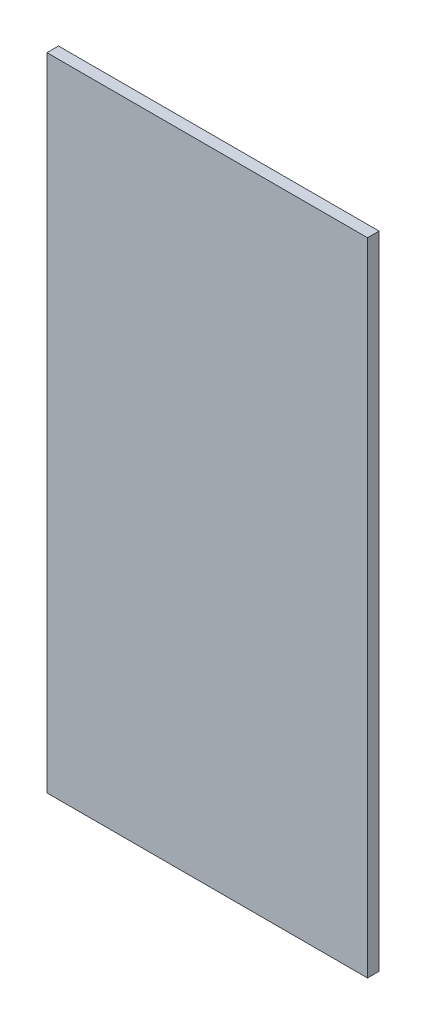
ISO-10303-21;
HEADER;
FILE_DESCRIPTION(('STEP AP214'),'2;1');
FILE_NAME('part.step','',(''),(''),'','','');
FILE_SCHEMA(('AUTOMOTIVE_DESIGN { 1 0 10303 214 1 1 1 1 }'));
ENDSEC;
DATA;
#1=APPLICATION_CONTEXT('core data for automotive mechanical design processes');
#2=APPLICATION_PROTOCOL_DEFINITION('international standard','automotive_design',2000,#1);
#3=PRODUCT_CONTEXT('',#1,'mechanical');
#4=PRODUCT('Part','Part','',(#3));
#5=PRODUCT_RELATED_PRODUCT_CATEGORY('part','',(#4));
#6=PRODUCT_DEFINITION_FORMATION('','',#4);
#7=PRODUCT_DEFINITION_CONTEXT('part definition',#1,'design');
#8=PRODUCT_DEFINITION('design','',#6,#7);
#9=PRODUCT_DEFINITION_SHAPE('','',#8);
#10=(LENGTH_UNIT() NAMED_UNIT(*) SI_UNIT(.MILLI.,.METRE.));
#11=(NAMED_UNIT(*) PLANE_ANGLE_UNIT() SI_UNIT($,.RADIAN.));
#12=(NAMED_UNIT(*) SI_UNIT($,.STERADIAN.) SOLID_ANGLE_UNIT());
#13=UNCERTAINTY_MEASURE_WITH_UNIT(LENGTH_MEASURE(1.E-05),#10,'distance_accuracy_value','');
#14=(GEOMETRIC_REPRESENTATION_CONTEXT(3) GLOBAL_UNCERTAINTY_ASSIGNED_CONTEXT((#13)) GLOBAL_UNIT_ASSIGNED_CONTEXT((#10,
#11,#12)) REPRESENTATION_CONTEXT('',''));
#15=CARTESIAN_POINT('',(0.,0.,0.));
#16=DIRECTION('',(0.,0.,1.));
#17=DIRECTION('',(1.,0.,0.));
#18=AXIS2_PLACEMENT_3D('',#15,#16,#17);
#19=CARTESIAN_POINT('',(-1.625,0.5,-0.018));
#20=DIRECTION('',(1.,0.,0.));
#21=DIRECTION('',(0.,0.,1.));
#22=AXIS2_PLACEMENT_3D('',#19,#20,#21);
#23=PLANE('',#22);
#24=CARTESIAN_POINT('',(-1.625,0.5,-0.018));
#25=CARTESIAN_POINT('',(-1.625,1.5,-0.018));
#26=B_SPLINE_CURVE_WITH_KNOTS('',1,(#24,#25),.UNSPECIFIED.,.F.,.F.,(2,2),(0.,1.),.UNSPECIFIED.);
#27=CARTESIAN_POINT('',(-1.625,0.5,-0.018));
#28=VERTEX_POINT('',#27);
#29=CARTESIAN_POINT('',(-1.625,1.5,-0.018));
#30=VERTEX_POINT('',#29);
#31=EDGE_CURVE('E11',#28,#30,#26,.T.);
#32=ORIENTED_EDGE('',*,*,#31,.T.);
#33=CARTESIAN_POINT('',(-1.625,1.5,-0.018));
#34=CARTESIAN_POINT('',(-1.625,1.5,0.));
#35=B_SPLINE_CURVE_WITH_KNOTS('',1,(#33,#34),.UNSPECIFIED.,.F.,.F.,(2,2),(0.,0.018),.UNSPECIFIED.);
#36=CARTESIAN_POINT('',(-1.625,1.5,0.));
#37=VERTEX_POINT('',#36);
#38=EDGE_CURVE('E26',#30,#37,#35,.T.);
#39=ORIENTED_EDGE('',*,*,#38,.T.);
#40=CARTESIAN_POINT('',(-1.625,0.5,0.));
#41=CARTESIAN_POINT('',(-1.625,1.5,0.));
#42=B_SPLINE_CURVE_WITH_KNOTS('',1,(#40,#41),.UNSPECIFIED.,.F.,.F.,(2,2),(0.,1.),.UNSPECIFIED.);
#43=CARTESIAN_POINT('',(-1.625,0.5,0.));
#44=VERTEX_POINT('',#43);
#45=EDGE_CURVE('E132',#44,#37,#42,.T.);
#46=ORIENTED_EDGE('',*,*,#45,.F.);
#47=CARTESIAN_POINT('',(-1.625,0.5,-0.018));
#48=CARTESIAN_POINT('',(-1.625,0.5,0.));
#49=B_SPLINE_CURVE_WITH_KNOTS('',1,(#47,#48),.UNSPECIFIED.,.F.,.F.,(2,2),(0.,0.018),.UNSPECIFIED.);
#50=EDGE_CURVE('E79',#28,#44,#49,.T.);
#51=ORIENTED_EDGE('',*,*,#50,.F.);
#52=EDGE_LOOP('',(#32,#39,#46,#51));
#53=FACE_BOUND('',#52,.T.);
#54=ADVANCED_FACE('F17',(#53),#23,.T.);
#55=CARTESIAN_POINT('',(-1.625,1.5,-0.018));
#56=DIRECTION('',(0.,1.,0.));
#57=DIRECTION('',(0.,0.,1.));
#58=AXIS2_PLACEMENT_3D('',#55,#56,#57);
#59=PLANE('',#58);
#60=CARTESIAN_POINT('',(-1.625,1.5,-0.018));
#61=CARTESIAN_POINT('',(-2.125,1.5,-0.018));
#62=B_SPLINE_CURVE_WITH_KNOTS('',1,(#60,#61),.UNSPECIFIED.,.F.,.F.,(2,2),(1.,1.5),.UNSPECIFIED.);
#63=CARTESIAN_POINT('',(-2.125,1.5,-0.018));
#64=VERTEX_POINT('',#63);
#65=EDGE_CURVE('E119',#30,#64,#62,.T.);
#66=ORIENTED_EDGE('',*,*,#65,.T.);
#67=CARTESIAN_POINT('',(-2.125,1.5,-0.018));
#68=CARTESIAN_POINT('',(-2.125,1.5,0.));
#69=B_SPLINE_CURVE_WITH_KNOTS('',1,(#67,#68),.UNSPECIFIED.,.F.,.F.,(2,2),(0.,0.018),.UNSPECIFIED.);
#70=CARTESIAN_POINT('',(-2.125,1.5,0.));
#71=VERTEX_POINT('',#70);
#72=EDGE_CURVE('E112',#64,#71,#69,.T.);
#73=ORIENTED_EDGE('',*,*,#72,.T.);
#74=CARTESIAN_POINT('',(-1.625,1.5,0.));
#75=CARTESIAN_POINT('',(-2.125,1.5,0.));
#76=B_SPLINE_CURVE_WITH_KNOTS('',1,(#74,#75),.UNSPECIFIED.,.F.,.F.,(2,2),(1.,1.5),.UNSPECIFIED.);
#77=EDGE_CURVE('E74',#37,#71,#76,.T.);
#78=ORIENTED_EDGE('',*,*,#77,.F.);
#79=ORIENTED_EDGE('',*,*,#38,.F.);
#80=EDGE_LOOP('',(#66,#73,#78,#79));
#81=FACE_BOUND('',#80,.T.);
#82=ADVANCED_FACE('F147',(#81),#59,.T.);
#83=CARTESIAN_POINT('',(-2.125,1.5,-0.018));
#84=DIRECTION('',(-1.,0.,0.));
#85=DIRECTION('',(0.,0.,-1.));
#86=AXIS2_PLACEMENT_3D('',#83,#84,#85);
#87=PLANE('',#86);
#88=CARTESIAN_POINT('',(-2.125,1.5,-0.018));
#89=CARTESIAN_POINT('',(-2.125,0.5,-0.018));
#90=B_SPLINE_CURVE_WITH_KNOTS('',1,(#88,#89),.UNSPECIFIED.,.F.,.F.,(2,2),(1.5,2.5),.UNSPECIFIED.);
#91=CARTESIAN_POINT('',(-2.125,0.5,-0.018));
#92=VERTEX_POINT('',#91);
#93=EDGE_CURVE('E62',#64,#92,#90,.T.);
#94=ORIENTED_EDGE('',*,*,#93,.T.);
#95=CARTESIAN_POINT('',(-2.125,0.5,-0.018));
#96=CARTESIAN_POINT('',(-2.125,0.5,0.));
#97=B_SPLINE_CURVE_WITH_KNOTS('',1,(#95,#96),.UNSPECIFIED.,.F.,.F.,(2,2),(0.,0.018),.UNSPECIFIED.);
#98=CARTESIAN_POINT('',(-2.125,0.5,0.));
#99=VERTEX_POINT('',#98);
#100=EDGE_CURVE('E56',#92,#99,#97,.T.);
#101=ORIENTED_EDGE('',*,*,#100,.T.);
#102=CARTESIAN_POINT('',(-2.125,1.5,0.));
#103=CARTESIAN_POINT('',(-2.125,0.5,0.));
#104=B_SPLINE_CURVE_WITH_KNOTS('',1,(#102,#103),.UNSPECIFIED.,.F.,.F.,(2,2),(1.5,2.5),.UNSPECIFIED.);
#105=EDGE_CURVE('E60',#71,#99,#104,.T.);
#106=ORIENTED_EDGE('',*,*,#105,.F.);
#107=ORIENTED_EDGE('',*,*,#72,.F.);
#108=EDGE_LOOP('',(#94,#101,#106,#107));
#109=FACE_BOUND('',#108,.T.);
#110=ADVANCED_FACE('F58',(#109),#87,.T.);
#111=CARTESIAN_POINT('',(-2.125,0.5,-0.018));
#112=DIRECTION('',(0.,-1.,0.));
#113=DIRECTION('',(0.,0.,-1.));
#114=AXIS2_PLACEMENT_3D('',#111,#112,#113);
#115=PLANE('',#114);
#116=CARTESIAN_POINT('',(-2.125,0.5,-0.018));
#117=CARTESIAN_POINT('',(-1.625,0.5,-0.018));
#118=B_SPLINE_CURVE_WITH_KNOTS('',1,(#116,#117),.UNSPECIFIED.,.F.,.F.,(2,2),(2.5,3.),.UNSPECIFIED.);
#119=EDGE_CURVE('E75',#92,#28,#118,.T.);
#120=ORIENTED_EDGE('',*,*,#119,.T.);
#121=ORIENTED_EDGE('',*,*,#50,.T.);
#122=CARTESIAN_POINT('',(-2.125,0.5,0.));
#123=CARTESIAN_POINT('',(-1.625,0.5,0.));
#124=B_SPLINE_CURVE_WITH_KNOTS('',1,(#122,#123),.UNSPECIFIED.,.F.,.F.,(2,2),(2.5,3.),.UNSPECIFIED.);
#125=EDGE_CURVE('E72',#99,#44,#124,.T.);
#126=ORIENTED_EDGE('',*,*,#125,.F.);
#127=ORIENTED_EDGE('',*,*,#100,.F.);
#128=EDGE_LOOP('',(#120,#121,#126,#127));
#129=FACE_BOUND('',#128,.T.);
#130=ADVANCED_FACE('F78',(#129),#115,.T.);
#131=CARTESIAN_POINT('',(-2.125,0.5,-0.018));
#132=DIRECTION('',(0.,0.,-1.));
#133=DIRECTION('',(-1.,0.,0.));
#134=AXIS2_PLACEMENT_3D('',#131,#132,#133);
#135=PLANE('',#134);
#136=ORIENTED_EDGE('',*,*,#119,.F.);
#137=ORIENTED_EDGE('',*,*,#93,.F.);
#138=ORIENTED_EDGE('',*,*,#65,.F.);
#139=ORIENTED_EDGE('',*,*,#31,.F.);
#140=EDGE_LOOP('',(#136,#137,#138,#139));
#141=FACE_BOUND('',#140,.T.);
#142=ADVANCED_FACE('F148',(#141),#135,.T.);
#143=CARTESIAN_POINT('',(-2.125,0.5,0.));
#144=DIRECTION('',(0.,0.,1.));
#145=DIRECTION('',(1.,0.,0.));
#146=AXIS2_PLACEMENT_3D('',#143,#144,#145);
#147=PLANE('',#146);
#148=ORIENTED_EDGE('',*,*,#45,.T.);
#149=ORIENTED_EDGE('',*,*,#77,.T.);
#150=ORIENTED_EDGE('',*,*,#105,.T.);
#151=ORIENTED_EDGE('',*,*,#125,.T.);
#152=EDGE_LOOP('',(#148,#149,#150,#151));
#153=FACE_BOUND('',#152,.T.);
#154=ADVANCED_FACE('F71',(#153),#147,.T.);
#155=CLOSED_SHELL('',(#54,#82,#110,#130,#142,#154));
#156=MANIFOLD_SOLID_BREP('B1',#155);
#157=ADVANCED_BREP_SHAPE_REPRESENTATION('',(#18,#156),#14);
#158=SHAPE_DEFINITION_REPRESENTATION(#9,#157);
ENDSEC;
END-ISO-10303-21;
